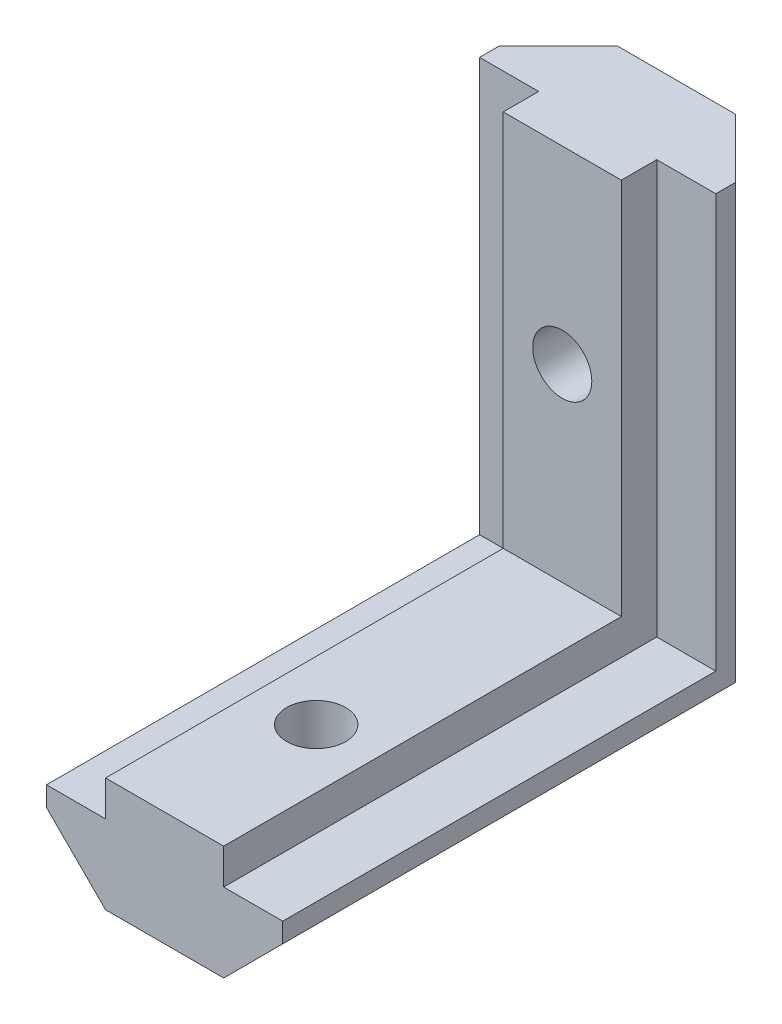
ISO-10303-21;
HEADER;
FILE_DESCRIPTION(('STEP AP214'),'2;1');
FILE_NAME('part.step','',(''),(''),'','','');
FILE_SCHEMA(('AUTOMOTIVE_DESIGN { 1 0 10303 214 1 1 1 1 }'));
ENDSEC;
DATA;
#1=APPLICATION_CONTEXT('core data for automotive mechanical design processes');
#2=APPLICATION_PROTOCOL_DEFINITION('international standard','automotive_design',2000,#1);
#3=PRODUCT_CONTEXT('',#1,'mechanical');
#4=PRODUCT('Part','Part','',(#3));
#5=PRODUCT_RELATED_PRODUCT_CATEGORY('part','',(#4));
#6=PRODUCT_DEFINITION_FORMATION('','',#4);
#7=PRODUCT_DEFINITION_CONTEXT('part definition',#1,'design');
#8=PRODUCT_DEFINITION('design','',#6,#7);
#9=PRODUCT_DEFINITION_SHAPE('','',#8);
#10=(LENGTH_UNIT() NAMED_UNIT(*) SI_UNIT(.MILLI.,.METRE.));
#11=(NAMED_UNIT(*) PLANE_ANGLE_UNIT() SI_UNIT($,.RADIAN.));
#12=(NAMED_UNIT(*) SI_UNIT($,.STERADIAN.) SOLID_ANGLE_UNIT());
#13=UNCERTAINTY_MEASURE_WITH_UNIT(LENGTH_MEASURE(1.E-05),#10,'distance_accuracy_value','');
#14=(GEOMETRIC_REPRESENTATION_CONTEXT(3) GLOBAL_UNCERTAINTY_ASSIGNED_CONTEXT((#13)) GLOBAL_UNIT_ASSIGNED_CONTEXT((#10,
#11,#12)) REPRESENTATION_CONTEXT('',''));
#15=CARTESIAN_POINT('',(0.,0.,0.));
#16=DIRECTION('',(0.,0.,1.));
#17=DIRECTION('',(1.,0.,0.));
#18=AXIS2_PLACEMENT_3D('',#15,#16,#17);
#19=CARTESIAN_POINT('',(6.,3.,26.));
#20=DIRECTION('',(-1.,0.,0.));
#21=DIRECTION('',(0.,0.,1.));
#22=AXIS2_PLACEMENT_3D('',#19,#20,#21);
#23=PLANE('',#22);
#24=DIRECTION('',(0.,0.,-1.));
#25=VECTOR('',#24,1.);
#26=CARTESIAN_POINT('',(6.,3.,26.));
#27=LINE('',#26,#25);
#28=CARTESIAN_POINT('',(6.,3.,26.));
#29=VERTEX_POINT('',#28);
#30=CARTESIAN_POINT('',(6.,3.,3.));
#31=VERTEX_POINT('',#30);
#32=EDGE_CURVE('E193',#29,#31,#27,.T.);
#33=ORIENTED_EDGE('',*,*,#32,.T.);
#34=DIRECTION('',(0.,-1.,0.));
#35=VECTOR('',#34,1.);
#36=CARTESIAN_POINT('',(6.,25.,3.));
#37=LINE('',#36,#35);
#38=CARTESIAN_POINT('',(6.,25.,3.));
#39=VERTEX_POINT('',#38);
#40=EDGE_CURVE('E208',#39,#31,#37,.T.);
#41=ORIENTED_EDGE('',*,*,#40,.F.);
#42=DIRECTION('',(0.,0.,-1.));
#43=VECTOR('',#42,1.);
#44=CARTESIAN_POINT('',(6.,25.,3.));
#45=LINE('',#44,#43);
#46=CARTESIAN_POINT('',(6.,25.,4.));
#47=VERTEX_POINT('',#46);
#48=EDGE_CURVE('E226',#47,#39,#45,.T.);
#49=ORIENTED_EDGE('',*,*,#48,.F.);
#50=DIRECTION('',(0.,-1.,0.));
#51=VECTOR('',#50,1.);
#52=CARTESIAN_POINT('',(6.,25.,4.));
#53=LINE('',#52,#51);
#54=CARTESIAN_POINT('',(6.,4.,4.00000000000001));
#55=VERTEX_POINT('',#54);
#56=EDGE_CURVE('E246',#47,#55,#53,.T.);
#57=ORIENTED_EDGE('',*,*,#56,.T.);
#58=DIRECTION('',(0.,0.,-1.));
#59=VECTOR('',#58,1.);
#60=CARTESIAN_POINT('',(6.,4.,26.));
#61=LINE('',#60,#59);
#62=CARTESIAN_POINT('',(6.,4.,26.));
#63=VERTEX_POINT('',#62);
#64=EDGE_CURVE('E58',#63,#55,#61,.T.);
#65=ORIENTED_EDGE('',*,*,#64,.F.);
#66=DIRECTION('',(0.,1.,0.));
#67=VECTOR('',#66,1.);
#68=CARTESIAN_POINT('',(6.,3.,26.));
#69=LINE('',#68,#67);
#70=EDGE_CURVE('E266',#29,#63,#69,.T.);
#71=ORIENTED_EDGE('',*,*,#70,.F.);
#72=EDGE_LOOP('',(#33,#41,#49,#57,#65,#71));
#73=FACE_BOUND('',#72,.T.);
#74=ADVANCED_FACE('F36',(#73),#23,.F.);
#75=CARTESIAN_POINT('',(-6.,3.,26.));
#76=DIRECTION('',(1.,0.,0.));
#77=DIRECTION('',(0.,0.,-1.));
#78=AXIS2_PLACEMENT_3D('',#75,#76,#77);
#79=PLANE('',#78);
#80=DIRECTION('',(0.,-1.,0.));
#81=VECTOR('',#80,1.);
#82=CARTESIAN_POINT('',(-6.,25.,3.));
#83=LINE('',#82,#81);
#84=CARTESIAN_POINT('',(-6.,25.,3.));
#85=VERTEX_POINT('',#84);
#86=CARTESIAN_POINT('',(-6.,3.,3.));
#87=VERTEX_POINT('',#86);
#88=EDGE_CURVE('E243',#85,#87,#83,.T.);
#89=ORIENTED_EDGE('',*,*,#88,.T.);
#90=DIRECTION('',(0.,0.,-1.));
#91=VECTOR('',#90,1.);
#92=CARTESIAN_POINT('',(-6.,3.,26.));
#93=LINE('',#92,#91);
#94=CARTESIAN_POINT('',(-6.,3.,26.));
#95=VERTEX_POINT('',#94);
#96=EDGE_CURVE('E51',#95,#87,#93,.T.);
#97=ORIENTED_EDGE('',*,*,#96,.F.);
#98=DIRECTION('',(0.,-1.,0.));
#99=VECTOR('',#98,1.);
#100=CARTESIAN_POINT('',(-6.,3.,26.));
#101=LINE('',#100,#99);
#102=CARTESIAN_POINT('',(-6.,4.,26.));
#103=VERTEX_POINT('',#102);
#104=EDGE_CURVE('E175',#103,#95,#101,.T.);
#105=ORIENTED_EDGE('',*,*,#104,.F.);
#106=DIRECTION('',(0.,0.,-1.));
#107=VECTOR('',#106,1.);
#108=CARTESIAN_POINT('',(-6.,4.,26.));
#109=LINE('',#108,#107);
#110=CARTESIAN_POINT('',(-6.,4.,4.00000000000001));
#111=VERTEX_POINT('',#110);
#112=EDGE_CURVE('E179',#103,#111,#109,.T.);
#113=ORIENTED_EDGE('',*,*,#112,.T.);
#114=DIRECTION('',(0.,-1.,0.));
#115=VECTOR('',#114,1.);
#116=CARTESIAN_POINT('',(-6.,25.,4.));
#117=LINE('',#116,#115);
#118=CARTESIAN_POINT('',(-6.,25.,4.));
#119=VERTEX_POINT('',#118);
#120=EDGE_CURVE('E240',#119,#111,#117,.T.);
#121=ORIENTED_EDGE('',*,*,#120,.F.);
#122=DIRECTION('',(0.,0.,1.));
#123=VECTOR('',#122,1.);
#124=CARTESIAN_POINT('',(-6.,25.,3.));
#125=LINE('',#124,#123);
#126=EDGE_CURVE('E234',#85,#119,#125,.T.);
#127=ORIENTED_EDGE('',*,*,#126,.F.);
#128=EDGE_LOOP('',(#89,#97,#105,#113,#121,#127));
#129=FACE_BOUND('',#128,.T.);
#130=ADVANCED_FACE('F282',(#129),#79,.F.);
#131=CARTESIAN_POINT('',(0.,0.,0.));
#132=DIRECTION('',(0.,0.,-1.));
#133=DIRECTION('',(-1.,0.,0.));
#134=AXIS2_PLACEMENT_3D('',#131,#132,#133);
#135=PLANE('',#134);
#136=CARTESIAN_POINT('',(0.,15.4,0.));
#137=DIRECTION('',(0.,0.,1.));
#138=DIRECTION('',(1.,0.,0.));
#139=AXIS2_PLACEMENT_3D('',#136,#137,#138);
#140=CIRCLE('',#139,1.5);
#141=CARTESIAN_POINT('',(1.5,15.4,0.));
#142=VERTEX_POINT('',#141);
#143=EDGE_CURVE('E210',#142,#142,#140,.T.);
#144=ORIENTED_EDGE('',*,*,#143,.T.);
#145=EDGE_LOOP('',(#144));
#146=FACE_BOUND('',#145,.T.);
#147=DIRECTION('',(1.,0.,0.));
#148=VECTOR('',#147,1.);
#149=CARTESIAN_POINT('',(3.00000000000001,0.,0.));
#150=LINE('',#149,#148);
#151=CARTESIAN_POINT('',(-3.00000000000001,0.,0.));
#152=VERTEX_POINT('',#151);
#153=CARTESIAN_POINT('',(3.00000000000001,0.,0.));
#154=VERTEX_POINT('',#153);
#155=EDGE_CURVE('E149',#152,#154,#150,.T.);
#156=ORIENTED_EDGE('',*,*,#155,.F.);
#157=DIRECTION('',(0.,-1.,0.));
#158=VECTOR('',#157,1.);
#159=CARTESIAN_POINT('',(-3.,4.,0.));
#160=LINE('',#159,#158);
#161=CARTESIAN_POINT('',(-3.00000000000001,25.,0.));
#162=VERTEX_POINT('',#161);
#163=EDGE_CURVE('E157',#162,#152,#160,.T.);
#164=ORIENTED_EDGE('',*,*,#163,.F.);
#165=DIRECTION('',(-1.,0.,0.));
#166=VECTOR('',#165,1.);
#167=CARTESIAN_POINT('',(3.00000000000001,25.,0.));
#168=LINE('',#167,#166);
#169=CARTESIAN_POINT('',(3.00000000000001,25.,0.));
#170=VERTEX_POINT('',#169);
#171=EDGE_CURVE('E231',#170,#162,#168,.T.);
#172=ORIENTED_EDGE('',*,*,#171,.F.);
#173=DIRECTION('',(0.,1.,0.));
#174=VECTOR('',#173,1.);
#175=CARTESIAN_POINT('',(3.,4.,0.));
#176=LINE('',#175,#174);
#177=EDGE_CURVE('E165',#154,#170,#176,.T.);
#178=ORIENTED_EDGE('',*,*,#177,.F.);
#179=EDGE_LOOP('',(#156,#164,#172,#178));
#180=FACE_BOUND('',#179,.T.);
#181=ADVANCED_FACE('F168',(#146,#180),#135,.T.);
#182=CARTESIAN_POINT('',(-3.00000000000001,0.,26.));
#183=DIRECTION('',(0.707106781186549,0.707106781186546,0.));
#184=DIRECTION('',(-0.707106781186546,0.707106781186549,0.));
#185=AXIS2_PLACEMENT_3D('',#182,#183,#184);
#186=PLANE('',#185);
#187=ORIENTED_EDGE('',*,*,#96,.T.);
#188=DIRECTION('',(-0.577350269189625,0.577350269189627,0.577350269189626));
#189=VECTOR('',#188,1.);
#190=CARTESIAN_POINT('',(-11.3333333333333,8.33333333333336,8.33333333333335));
#191=LINE('',#190,#189);
#192=EDGE_CURVE('E11',#152,#87,#191,.T.);
#193=ORIENTED_EDGE('',*,*,#192,.F.);
#194=DIRECTION('',(0.,0.,-1.));
#195=VECTOR('',#194,1.);
#196=CARTESIAN_POINT('',(-3.00000000000001,0.,26.));
#197=LINE('',#196,#195);
#198=CARTESIAN_POINT('',(-3.00000000000001,0.,26.));
#199=VERTEX_POINT('',#198);
#200=EDGE_CURVE('E44',#199,#152,#197,.T.);
#201=ORIENTED_EDGE('',*,*,#200,.F.);
#202=DIRECTION('',(0.707106781186546,-0.707106781186549,0.));
#203=VECTOR('',#202,1.);
#204=CARTESIAN_POINT('',(-3.00000000000001,0.,26.));
#205=LINE('',#204,#203);
#206=EDGE_CURVE('E164',#95,#199,#205,.T.);
#207=ORIENTED_EDGE('',*,*,#206,.F.);
#208=EDGE_LOOP('',(#187,#193,#201,#207));
#209=FACE_BOUND('',#208,.T.);
#210=ADVANCED_FACE('F38',(#209),#186,.F.);
#211=CARTESIAN_POINT('',(3.00000000000001,0.,26.));
#212=DIRECTION('',(-0.707106781186549,0.707106781186546,0.));
#213=DIRECTION('',(-0.707106781186546,-0.707106781186549,0.));
#214=AXIS2_PLACEMENT_3D('',#211,#212,#213);
#215=PLANE('',#214);
#216=DIRECTION('',(0.,0.,-1.));
#217=VECTOR('',#216,1.);
#218=CARTESIAN_POINT('',(3.00000000000001,0.,26.));
#219=LINE('',#218,#217);
#220=CARTESIAN_POINT('',(3.00000000000001,0.,26.));
#221=VERTEX_POINT('',#220);
#222=EDGE_CURVE('E152',#221,#154,#219,.T.);
#223=ORIENTED_EDGE('',*,*,#222,.T.);
#224=DIRECTION('',(-0.577350269189625,-0.577350269189626,-0.577350269189627));
#225=VECTOR('',#224,1.);
#226=CARTESIAN_POINT('',(11.3333333333333,8.33333333333335,8.33333333333335));
#227=LINE('',#226,#225);
#228=EDGE_CURVE('E201',#31,#154,#227,.T.);
#229=ORIENTED_EDGE('',*,*,#228,.F.);
#230=ORIENTED_EDGE('',*,*,#32,.F.);
#231=DIRECTION('',(0.707106781186546,0.707106781186549,0.));
#232=VECTOR('',#231,1.);
#233=CARTESIAN_POINT('',(3.00000000000001,0.,26.));
#234=LINE('',#233,#232);
#235=EDGE_CURVE('E203',#221,#29,#234,.T.);
#236=ORIENTED_EDGE('',*,*,#235,.F.);
#237=EDGE_LOOP('',(#223,#229,#230,#236));
#238=FACE_BOUND('',#237,.T.);
#239=ADVANCED_FACE('F199',(#238),#215,.F.);
#240=CARTESIAN_POINT('',(6.,4.,26.));
#241=DIRECTION('',(0.,-1.,0.));
#242=DIRECTION('',(0.,0.,-1.));
#243=AXIS2_PLACEMENT_3D('',#240,#241,#242);
#244=PLANE('',#243);
#245=DIRECTION('',(1.,0.,0.));
#246=VECTOR('',#245,1.);
#247=CARTESIAN_POINT('',(6.,4.,4.));
#248=LINE('',#247,#246);
#249=CARTESIAN_POINT('',(3.,4.,4.00000000000001));
#250=VERTEX_POINT('',#249);
#251=EDGE_CURVE('E169',#250,#55,#248,.T.);
#252=ORIENTED_EDGE('',*,*,#251,.F.);
#253=DIRECTION('',(0.,0.,-1.));
#254=VECTOR('',#253,1.);
#255=CARTESIAN_POINT('',(3.,4.,26.));
#256=LINE('',#255,#254);
#257=CARTESIAN_POINT('',(3.,4.,26.));
#258=VERTEX_POINT('',#257);
#259=EDGE_CURVE('E190',#258,#250,#256,.T.);
#260=ORIENTED_EDGE('',*,*,#259,.F.);
#261=DIRECTION('',(-1.,0.,0.));
#262=VECTOR('',#261,1.);
#263=CARTESIAN_POINT('',(6.,4.,26.));
#264=LINE('',#263,#262);
#265=EDGE_CURVE('E268',#63,#258,#264,.T.);
#266=ORIENTED_EDGE('',*,*,#265,.F.);
#267=ORIENTED_EDGE('',*,*,#64,.T.);
#268=EDGE_LOOP('',(#252,#260,#266,#267));
#269=FACE_BOUND('',#268,.T.);
#270=ADVANCED_FACE('F295',(#269),#244,.F.);
#271=CARTESIAN_POINT('',(3.,4.,26.));
#272=DIRECTION('',(-1.,0.,0.));
#273=DIRECTION('',(0.,0.,1.));
#274=AXIS2_PLACEMENT_3D('',#271,#272,#273);
#275=PLANE('',#274);
#276=DIRECTION('',(0.,-1.,0.));
#277=VECTOR('',#276,1.);
#278=CARTESIAN_POINT('',(3.,25.,4.));
#279=LINE('',#278,#277);
#280=CARTESIAN_POINT('',(3.,25.,4.));
#281=VERTEX_POINT('',#280);
#282=EDGE_CURVE('E249',#281,#250,#279,.T.);
#283=ORIENTED_EDGE('',*,*,#282,.F.);
#284=DIRECTION('',(0.,0.,-1.));
#285=VECTOR('',#284,1.);
#286=CARTESIAN_POINT('',(3.,25.,4.));
#287=LINE('',#286,#285);
#288=CARTESIAN_POINT('',(3.,25.,5.8));
#289=VERTEX_POINT('',#288);
#290=EDGE_CURVE('E221',#289,#281,#287,.T.);
#291=ORIENTED_EDGE('',*,*,#290,.F.);
#292=DIRECTION('',(0.,-1.,0.));
#293=VECTOR('',#292,1.);
#294=CARTESIAN_POINT('',(3.,25.,5.8));
#295=LINE('',#294,#293);
#296=CARTESIAN_POINT('',(3.,5.8,5.80000000000001));
#297=VERTEX_POINT('',#296);
#298=EDGE_CURVE('E252',#289,#297,#295,.T.);
#299=ORIENTED_EDGE('',*,*,#298,.T.);
#300=DIRECTION('',(0.,0.,-1.));
#301=VECTOR('',#300,1.);
#302=CARTESIAN_POINT('',(3.,5.8,26.));
#303=LINE('',#302,#301);
#304=CARTESIAN_POINT('',(3.,5.8,26.));
#305=VERTEX_POINT('',#304);
#306=EDGE_CURVE('E188',#305,#297,#303,.T.);
#307=ORIENTED_EDGE('',*,*,#306,.F.);
#308=DIRECTION('',(0.,1.,0.));
#309=VECTOR('',#308,1.);
#310=CARTESIAN_POINT('',(3.,4.,26.));
#311=LINE('',#310,#309);
#312=EDGE_CURVE('E270',#258,#305,#311,.T.);
#313=ORIENTED_EDGE('',*,*,#312,.F.);
#314=ORIENTED_EDGE('',*,*,#259,.T.);
#315=EDGE_LOOP('',(#283,#291,#299,#307,#313,#314));
#316=FACE_BOUND('',#315,.T.);
#317=ADVANCED_FACE('F297',(#316),#275,.F.);
#318=CARTESIAN_POINT('',(-3.,5.8,26.));
#319=DIRECTION('',(0.,-1.,0.));
#320=DIRECTION('',(0.,0.,-1.));
#321=AXIS2_PLACEMENT_3D('',#318,#319,#320);
#322=PLANE('',#321);
#323=CARTESIAN_POINT('',(0.,5.8,18.3));
#324=DIRECTION('',(0.,1.,0.));
#325=DIRECTION('',(0.,0.,1.));
#326=AXIS2_PLACEMENT_3D('',#323,#324,#325);
#327=CIRCLE('',#326,1.5);
#328=CARTESIAN_POINT('',(0.,5.8,19.8));
#329=VERTEX_POINT('',#328);
#330=EDGE_CURVE('E351',#329,#329,#327,.T.);
#331=ORIENTED_EDGE('',*,*,#330,.F.);
#332=EDGE_LOOP('',(#331));
#333=FACE_BOUND('',#332,.T.);
#334=DIRECTION('',(1.,0.,0.));
#335=VECTOR('',#334,1.);
#336=CARTESIAN_POINT('',(-3.,5.8,5.8));
#337=LINE('',#336,#335);
#338=CARTESIAN_POINT('',(-3.,5.8,5.80000000000001));
#339=VERTEX_POINT('',#338);
#340=EDGE_CURVE('E172',#339,#297,#337,.T.);
#341=ORIENTED_EDGE('',*,*,#340,.F.);
#342=DIRECTION('',(0.,0.,-1.));
#343=VECTOR('',#342,1.);
#344=CARTESIAN_POINT('',(-3.,5.8,26.));
#345=LINE('',#344,#343);
#346=CARTESIAN_POINT('',(-3.,5.8,26.));
#347=VERTEX_POINT('',#346);
#348=EDGE_CURVE('E185',#347,#339,#345,.T.);
#349=ORIENTED_EDGE('',*,*,#348,.F.);
#350=DIRECTION('',(-1.,0.,0.));
#351=VECTOR('',#350,1.);
#352=CARTESIAN_POINT('',(-3.,5.8,26.));
#353=LINE('',#352,#351);
#354=EDGE_CURVE('E272',#305,#347,#353,.T.);
#355=ORIENTED_EDGE('',*,*,#354,.F.);
#356=ORIENTED_EDGE('',*,*,#306,.T.);
#357=EDGE_LOOP('',(#341,#349,#355,#356));
#358=FACE_BOUND('',#357,.T.);
#359=ADVANCED_FACE('F303',(#333,#358),#322,.F.);
#360=CARTESIAN_POINT('',(-3.,4.,26.));
#361=DIRECTION('',(1.,0.,0.));
#362=DIRECTION('',(0.,0.,-1.));
#363=AXIS2_PLACEMENT_3D('',#360,#361,#362);
#364=PLANE('',#363);
#365=DIRECTION('',(0.,-1.,0.));
#366=VECTOR('',#365,1.);
#367=CARTESIAN_POINT('',(-3.,25.,4.));
#368=LINE('',#367,#366);
#369=CARTESIAN_POINT('',(-3.,25.,4.));
#370=VERTEX_POINT('',#369);
#371=CARTESIAN_POINT('',(-3.,4.,4.00000000000001));
#372=VERTEX_POINT('',#371);
#373=EDGE_CURVE('E238',#370,#372,#368,.T.);
#374=ORIENTED_EDGE('',*,*,#373,.T.);
#375=DIRECTION('',(0.,0.,-1.));
#376=VECTOR('',#375,1.);
#377=CARTESIAN_POINT('',(-3.,4.,26.));
#378=LINE('',#377,#376);
#379=CARTESIAN_POINT('',(-3.,4.,26.));
#380=VERTEX_POINT('',#379);
#381=EDGE_CURVE('E182',#380,#372,#378,.T.);
#382=ORIENTED_EDGE('',*,*,#381,.F.);
#383=DIRECTION('',(0.,-1.,0.));
#384=VECTOR('',#383,1.);
#385=CARTESIAN_POINT('',(-3.,4.,26.));
#386=LINE('',#385,#384);
#387=EDGE_CURVE('E274',#347,#380,#386,.T.);
#388=ORIENTED_EDGE('',*,*,#387,.F.);
#389=ORIENTED_EDGE('',*,*,#348,.T.);
#390=DIRECTION('',(0.,-1.,0.));
#391=VECTOR('',#390,1.);
#392=CARTESIAN_POINT('',(-3.,25.,5.8));
#393=LINE('',#392,#391);
#394=CARTESIAN_POINT('',(-3.,25.,5.8));
#395=VERTEX_POINT('',#394);
#396=EDGE_CURVE('E255',#395,#339,#393,.T.);
#397=ORIENTED_EDGE('',*,*,#396,.F.);
#398=DIRECTION('',(0.,0.,1.));
#399=VECTOR('',#398,1.);
#400=CARTESIAN_POINT('',(-3.,25.,4.));
#401=LINE('',#400,#399);
#402=EDGE_CURVE('E209',#370,#395,#401,.T.);
#403=ORIENTED_EDGE('',*,*,#402,.F.);
#404=EDGE_LOOP('',(#374,#382,#388,#389,#397,#403));
#405=FACE_BOUND('',#404,.T.);
#406=ADVANCED_FACE('F307',(#405),#364,.F.);
#407=CARTESIAN_POINT('',(-6.,4.,26.));
#408=DIRECTION('',(0.,-1.,0.));
#409=DIRECTION('',(0.,0.,-1.));
#410=AXIS2_PLACEMENT_3D('',#407,#408,#409);
#411=PLANE('',#410);
#412=DIRECTION('',(1.,0.,0.));
#413=VECTOR('',#412,1.);
#414=CARTESIAN_POINT('',(-6.,4.,4.));
#415=LINE('',#414,#413);
#416=EDGE_CURVE('E258',#111,#372,#415,.T.);
#417=ORIENTED_EDGE('',*,*,#416,.F.);
#418=ORIENTED_EDGE('',*,*,#112,.F.);
#419=DIRECTION('',(-1.,0.,0.));
#420=VECTOR('',#419,1.);
#421=CARTESIAN_POINT('',(-6.,4.,26.));
#422=LINE('',#421,#420);
#423=EDGE_CURVE('E275',#380,#103,#422,.T.);
#424=ORIENTED_EDGE('',*,*,#423,.F.);
#425=ORIENTED_EDGE('',*,*,#381,.T.);
#426=EDGE_LOOP('',(#417,#418,#424,#425));
#427=FACE_BOUND('',#426,.T.);
#428=ADVANCED_FACE('F311',(#427),#411,.F.);
#429=CARTESIAN_POINT('',(3.00000000000001,0.,26.));
#430=DIRECTION('',(0.,1.,0.));
#431=DIRECTION('',(0.,0.,1.));
#432=AXIS2_PLACEMENT_3D('',#429,#430,#431);
#433=PLANE('',#432);
#434=CARTESIAN_POINT('',(0.,0.,18.3));
#435=DIRECTION('',(0.,1.,0.));
#436=DIRECTION('',(0.,0.,1.));
#437=AXIS2_PLACEMENT_3D('',#434,#435,#436);
#438=CIRCLE('',#437,1.5);
#439=CARTESIAN_POINT('',(0.,0.,19.8));
#440=VERTEX_POINT('',#439);
#441=EDGE_CURVE('E349',#440,#440,#438,.T.);
#442=ORIENTED_EDGE('',*,*,#441,.T.);
#443=EDGE_LOOP('',(#442));
#444=FACE_BOUND('',#443,.T.);
#445=ORIENTED_EDGE('',*,*,#200,.T.);
#446=ORIENTED_EDGE('',*,*,#155,.T.);
#447=ORIENTED_EDGE('',*,*,#222,.F.);
#448=DIRECTION('',(1.,0.,0.));
#449=VECTOR('',#448,1.);
#450=CARTESIAN_POINT('',(3.00000000000001,0.,26.));
#451=LINE('',#450,#449);
#452=EDGE_CURVE('E150',#199,#221,#451,.T.);
#453=ORIENTED_EDGE('',*,*,#452,.F.);
#454=EDGE_LOOP('',(#445,#446,#447,#453));
#455=FACE_BOUND('',#454,.T.);
#456=ADVANCED_FACE('F146',(#444,#455),#433,.F.);
#457=CARTESIAN_POINT('',(0.,0.,26.));
#458=DIRECTION('',(0.,0.,-1.));
#459=DIRECTION('',(-1.,0.,0.));
#460=AXIS2_PLACEMENT_3D('',#457,#458,#459);
#461=PLANE('',#460);
#462=ORIENTED_EDGE('',*,*,#206,.T.);
#463=ORIENTED_EDGE('',*,*,#452,.T.);
#464=ORIENTED_EDGE('',*,*,#235,.T.);
#465=ORIENTED_EDGE('',*,*,#70,.T.);
#466=ORIENTED_EDGE('',*,*,#265,.T.);
#467=ORIENTED_EDGE('',*,*,#312,.T.);
#468=ORIENTED_EDGE('',*,*,#354,.T.);
#469=ORIENTED_EDGE('',*,*,#387,.T.);
#470=ORIENTED_EDGE('',*,*,#423,.T.);
#471=ORIENTED_EDGE('',*,*,#104,.T.);
#472=EDGE_LOOP('',(#462,#463,#464,#465,#466,#467,#468,#469,#470,#471));
#473=FACE_BOUND('',#472,.T.);
#474=ADVANCED_FACE('F280',(#473),#461,.F.);
#475=CARTESIAN_POINT('',(0.,25.,0.));
#476=DIRECTION('',(0.,-1.,0.));
#477=DIRECTION('',(0.,0.,-1.));
#478=AXIS2_PLACEMENT_3D('',#475,#476,#477);
#479=PLANE('',#478);
#480=ORIENTED_EDGE('',*,*,#402,.T.);
#481=DIRECTION('',(1.,0.,0.));
#482=VECTOR('',#481,1.);
#483=CARTESIAN_POINT('',(3.,25.,5.8));
#484=LINE('',#483,#482);
#485=EDGE_CURVE('E213',#395,#289,#484,.T.);
#486=ORIENTED_EDGE('',*,*,#485,.T.);
#487=ORIENTED_EDGE('',*,*,#290,.T.);
#488=DIRECTION('',(1.,0.,0.));
#489=VECTOR('',#488,1.);
#490=CARTESIAN_POINT('',(6.,25.,4.));
#491=LINE('',#490,#489);
#492=EDGE_CURVE('E224',#281,#47,#491,.T.);
#493=ORIENTED_EDGE('',*,*,#492,.T.);
#494=ORIENTED_EDGE('',*,*,#48,.T.);
#495=DIRECTION('',(-0.707106781186546,0.,-0.707106781186549));
#496=VECTOR('',#495,1.);
#497=CARTESIAN_POINT('',(3.00000000000001,25.,0.));
#498=LINE('',#497,#496);
#499=EDGE_CURVE('E229',#39,#170,#498,.T.);
#500=ORIENTED_EDGE('',*,*,#499,.T.);
#501=ORIENTED_EDGE('',*,*,#171,.T.);
#502=DIRECTION('',(-0.707106781186546,0.,0.707106781186549));
#503=VECTOR('',#502,1.);
#504=CARTESIAN_POINT('',(-3.00000000000001,25.,0.));
#505=LINE('',#504,#503);
#506=EDGE_CURVE('E160',#162,#85,#505,.T.);
#507=ORIENTED_EDGE('',*,*,#506,.T.);
#508=ORIENTED_EDGE('',*,*,#126,.T.);
#509=DIRECTION('',(1.,0.,0.));
#510=VECTOR('',#509,1.);
#511=CARTESIAN_POINT('',(-6.,25.,4.));
#512=LINE('',#511,#510);
#513=EDGE_CURVE('E236',#119,#370,#512,.T.);
#514=ORIENTED_EDGE('',*,*,#513,.T.);
#515=EDGE_LOOP('',(#480,#486,#487,#493,#494,#500,#501,#507,#508,#514));
#516=FACE_BOUND('',#515,.T.);
#517=ADVANCED_FACE('F286',(#516),#479,.F.);
#518=CARTESIAN_POINT('',(3.,25.,5.8));
#519=DIRECTION('',(0.,0.,-1.));
#520=DIRECTION('',(-1.,0.,0.));
#521=AXIS2_PLACEMENT_3D('',#518,#519,#520);
#522=PLANE('',#521);
#523=CARTESIAN_POINT('',(0.,15.4,5.8));
#524=DIRECTION('',(0.,0.,1.));
#525=DIRECTION('',(1.,0.,0.));
#526=AXIS2_PLACEMENT_3D('',#523,#524,#525);
#527=CIRCLE('',#526,1.5);
#528=CARTESIAN_POINT('',(1.5,15.4,5.8));
#529=VERTEX_POINT('',#528);
#530=EDGE_CURVE('E216',#529,#529,#527,.T.);
#531=ORIENTED_EDGE('',*,*,#530,.F.);
#532=EDGE_LOOP('',(#531));
#533=FACE_BOUND('',#532,.T.);
#534=ORIENTED_EDGE('',*,*,#396,.T.);
#535=ORIENTED_EDGE('',*,*,#340,.T.);
#536=ORIENTED_EDGE('',*,*,#298,.F.);
#537=ORIENTED_EDGE('',*,*,#485,.F.);
#538=EDGE_LOOP('',(#534,#535,#536,#537));
#539=FACE_BOUND('',#538,.T.);
#540=ADVANCED_FACE('F317',(#533,#539),#522,.F.);
#541=CARTESIAN_POINT('',(-6.,25.,4.));
#542=DIRECTION('',(0.,0.,-1.));
#543=DIRECTION('',(-1.,0.,0.));
#544=AXIS2_PLACEMENT_3D('',#541,#542,#543);
#545=PLANE('',#544);
#546=ORIENTED_EDGE('',*,*,#120,.T.);
#547=ORIENTED_EDGE('',*,*,#416,.T.);
#548=ORIENTED_EDGE('',*,*,#373,.F.);
#549=ORIENTED_EDGE('',*,*,#513,.F.);
#550=EDGE_LOOP('',(#546,#547,#548,#549));
#551=FACE_BOUND('',#550,.T.);
#552=ADVANCED_FACE('F314',(#551),#545,.F.);
#553=CARTESIAN_POINT('',(6.,25.,4.));
#554=DIRECTION('',(0.,0.,-1.));
#555=DIRECTION('',(-1.,0.,0.));
#556=AXIS2_PLACEMENT_3D('',#553,#554,#555);
#557=PLANE('',#556);
#558=ORIENTED_EDGE('',*,*,#282,.T.);
#559=ORIENTED_EDGE('',*,*,#251,.T.);
#560=ORIENTED_EDGE('',*,*,#56,.F.);
#561=ORIENTED_EDGE('',*,*,#492,.F.);
#562=EDGE_LOOP('',(#558,#559,#560,#561));
#563=FACE_BOUND('',#562,.T.);
#564=ADVANCED_FACE('F319',(#563),#557,.F.);
#565=CARTESIAN_POINT('',(3.00000000000001,25.,0.));
#566=DIRECTION('',(-0.707106781186549,0.,0.707106781186546));
#567=DIRECTION('',(0.707106781186546,0.,0.707106781186549));
#568=AXIS2_PLACEMENT_3D('',#565,#566,#567);
#569=PLANE('',#568);
#570=ORIENTED_EDGE('',*,*,#40,.T.);
#571=ORIENTED_EDGE('',*,*,#228,.T.);
#572=ORIENTED_EDGE('',*,*,#177,.T.);
#573=ORIENTED_EDGE('',*,*,#499,.F.);
#574=EDGE_LOOP('',(#570,#571,#572,#573));
#575=FACE_BOUND('',#574,.T.);
#576=ADVANCED_FACE('F205',(#575),#569,.F.);
#577=CARTESIAN_POINT('',(-3.00000000000001,25.,0.));
#578=DIRECTION('',(0.707106781186549,0.,0.707106781186547));
#579=DIRECTION('',(0.707106781186547,0.,-0.707106781186549));
#580=AXIS2_PLACEMENT_3D('',#577,#578,#579);
#581=PLANE('',#580);
#582=ORIENTED_EDGE('',*,*,#163,.T.);
#583=ORIENTED_EDGE('',*,*,#192,.T.);
#584=ORIENTED_EDGE('',*,*,#88,.F.);
#585=ORIENTED_EDGE('',*,*,#506,.F.);
#586=EDGE_LOOP('',(#582,#583,#584,#585));
#587=FACE_BOUND('',#586,.T.);
#588=ADVANCED_FACE('F158',(#587),#581,.F.);
#589=CARTESIAN_POINT('',(0.,15.4,0.));
#590=DIRECTION('',(0.,0.,1.));
#591=DIRECTION('',(1.,0.,0.));
#592=AXIS2_PLACEMENT_3D('',#589,#590,#591);
#593=CYLINDRICAL_SURFACE('',#592,1.5);
#594=ORIENTED_EDGE('',*,*,#143,.F.);
#595=EDGE_LOOP('',(#594));
#596=FACE_BOUND('',#595,.T.);
#597=ORIENTED_EDGE('',*,*,#530,.T.);
#598=EDGE_LOOP('',(#597));
#599=FACE_BOUND('',#598,.T.);
#600=ADVANCED_FACE('F378',(#596,#599),#593,.F.);
#601=CARTESIAN_POINT('',(0.,0.,18.3));
#602=DIRECTION('',(0.,1.,0.));
#603=DIRECTION('',(0.,0.,1.));
#604=AXIS2_PLACEMENT_3D('',#601,#602,#603);
#605=CYLINDRICAL_SURFACE('',#604,1.5);
#606=ORIENTED_EDGE('',*,*,#441,.F.);
#607=EDGE_LOOP('',(#606));
#608=FACE_BOUND('',#607,.T.);
#609=ORIENTED_EDGE('',*,*,#330,.T.);
#610=EDGE_LOOP('',(#609));
#611=FACE_BOUND('',#610,.T.);
#612=ADVANCED_FACE('F358',(#608,#611),#605,.F.);
#613=CLOSED_SHELL('',(#74,#130,#181,#210,#239,#270,#317,#359,#406,#428,#456,#474,#517,#540,#552,
#564,#576,#588,#600,#612));
#614=MANIFOLD_SOLID_BREP('B2',#613);
#615=ADVANCED_BREP_SHAPE_REPRESENTATION('',(#18,#614),#14);
#616=SHAPE_DEFINITION_REPRESENTATION(#9,#615);
ENDSEC;
END-ISO-10303-21;
